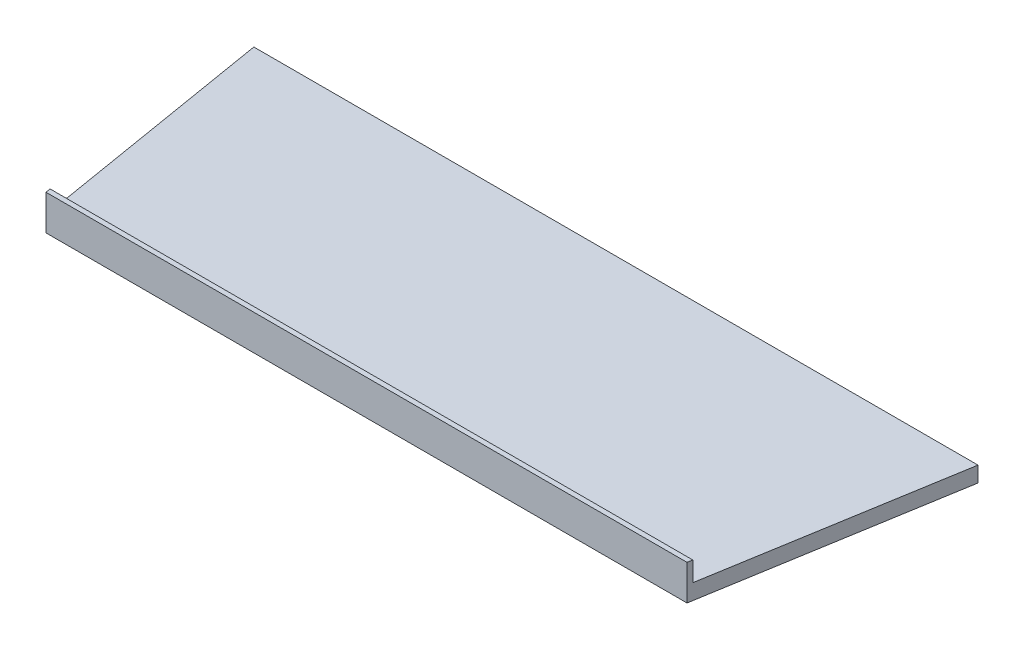
ISO-10303-21;
HEADER;
FILE_DESCRIPTION(('STEP AP214'),'2;1');
FILE_NAME('part.step','',(''),(''),'','','');
FILE_SCHEMA(('AUTOMOTIVE_DESIGN { 1 0 10303 214 1 1 1 1 }'));
ENDSEC;
DATA;
#1=APPLICATION_CONTEXT('core data for automotive mechanical design processes');
#2=APPLICATION_PROTOCOL_DEFINITION('international standard','automotive_design',2000,#1);
#3=PRODUCT_CONTEXT('',#1,'mechanical');
#4=PRODUCT('Part','Part','',(#3));
#5=PRODUCT_RELATED_PRODUCT_CATEGORY('part','',(#4));
#6=PRODUCT_DEFINITION_FORMATION('','',#4);
#7=PRODUCT_DEFINITION_CONTEXT('part definition',#1,'design');
#8=PRODUCT_DEFINITION('design','',#6,#7);
#9=PRODUCT_DEFINITION_SHAPE('','',#8);
#10=(LENGTH_UNIT() NAMED_UNIT(*) SI_UNIT(.MILLI.,.METRE.));
#11=(NAMED_UNIT(*) PLANE_ANGLE_UNIT() SI_UNIT($,.RADIAN.));
#12=(NAMED_UNIT(*) SI_UNIT($,.STERADIAN.) SOLID_ANGLE_UNIT());
#13=UNCERTAINTY_MEASURE_WITH_UNIT(LENGTH_MEASURE(1.E-05),#10,'distance_accuracy_value','');
#14=(GEOMETRIC_REPRESENTATION_CONTEXT(3) GLOBAL_UNCERTAINTY_ASSIGNED_CONTEXT((#13)) GLOBAL_UNIT_ASSIGNED_CONTEXT((#10,
#11,#12)) REPRESENTATION_CONTEXT('',''));
#15=CARTESIAN_POINT('',(0.,0.,0.));
#16=DIRECTION('',(0.,0.,1.));
#17=DIRECTION('',(1.,0.,0.));
#18=AXIS2_PLACEMENT_3D('',#15,#16,#17);
#19=CARTESIAN_POINT('',(200.177654251354,10.,33.3629423752253));
#20=DIRECTION('',(0.986393923832144,0.,0.164398987305356));
#21=DIRECTION('',(0.164398987305356,0.,-0.986393923832144));
#22=AXIS2_PLACEMENT_3D('',#19,#20,#21);
#23=PLANE('',#22);
#24=DIRECTION('',(-0.164398987305356,0.,0.986393923832144));
#25=VECTOR('',#24,1.);
#26=CARTESIAN_POINT('',(200.177654251354,0.,33.3629423752253));
#27=LINE('',#26,#25);
#28=CARTESIAN_POINT('',(218.189405391345,0.,-74.7075644647225));
#29=VERTEX_POINT('',#28);
#30=CARTESIAN_POINT('',(191.397738724679,0.,86.0424355352775));
#31=VERTEX_POINT('',#30);
#32=EDGE_CURVE('E102',#29,#31,#27,.T.);
#33=ORIENTED_EDGE('',*,*,#32,.F.);
#34=DIRECTION('',(0.,-1.,0.));
#35=VECTOR('',#34,1.);
#36=CARTESIAN_POINT('',(218.189405391345,10.,-74.7075644647225));
#37=LINE('',#36,#35);
#38=CARTESIAN_POINT('',(218.189405391345,10.,-74.7075644647225));
#39=VERTEX_POINT('',#38);
#40=EDGE_CURVE('E104',#39,#29,#37,.T.);
#41=ORIENTED_EDGE('',*,*,#40,.F.);
#42=DIRECTION('',(-0.164398987305356,0.,0.986393923832144));
#43=VECTOR('',#42,1.);
#44=CARTESIAN_POINT('',(200.177654251354,10.,33.3629423752253));
#45=LINE('',#44,#43);
#46=CARTESIAN_POINT('',(191.926905391345,10.,82.8674355352775));
#47=VERTEX_POINT('',#46);
#48=EDGE_CURVE('E132',#39,#47,#45,.T.);
#49=ORIENTED_EDGE('',*,*,#48,.T.);
#50=DIRECTION('',(0.,-1.,0.));
#51=VECTOR('',#50,1.);
#52=CARTESIAN_POINT('',(191.926905391345,22.7,82.8674355352775));
#53=LINE('',#52,#51);
#54=CARTESIAN_POINT('',(191.926905391345,22.7,82.8674355352775));
#55=VERTEX_POINT('',#54);
#56=EDGE_CURVE('E121',#55,#47,#53,.T.);
#57=ORIENTED_EDGE('',*,*,#56,.F.);
#58=DIRECTION('',(0.164398987305359,0.,-0.986393923832143));
#59=VECTOR('',#58,1.);
#60=CARTESIAN_POINT('',(191.397738724679,22.7,86.0424355352775));
#61=LINE('',#60,#59);
#62=CARTESIAN_POINT('',(191.397738724679,22.7,86.0424355352775));
#63=VERTEX_POINT('',#62);
#64=EDGE_CURVE('E143',#63,#55,#61,.T.);
#65=ORIENTED_EDGE('',*,*,#64,.F.);
#66=DIRECTION('',(0.,-1.,0.));
#67=VECTOR('',#66,1.);
#68=CARTESIAN_POINT('',(191.397738724679,10.,86.0424355352775));
#69=LINE('',#68,#67);
#70=EDGE_CURVE('E71',#63,#31,#69,.T.);
#71=ORIENTED_EDGE('',*,*,#70,.T.);
#72=EDGE_LOOP('',(#33,#41,#49,#57,#65,#71));
#73=FACE_BOUND('',#72,.T.);
#74=ADVANCED_FACE('F62',(#73),#23,.T.);
#75=CARTESIAN_POINT('',(-229.70367619252,10.,38.2839460320869));
#76=DIRECTION('',(0.986393923832144,0.,-0.164398987305359));
#77=DIRECTION('',(-0.164398987305359,0.,-0.986393923832144));
#78=AXIS2_PLACEMENT_3D('',#75,#76,#77);
#79=PLANE('',#78);
#80=DIRECTION('',(0.164398987305359,0.,0.986393923832144));
#81=VECTOR('',#80,1.);
#82=CARTESIAN_POINT('',(-229.70367619252,0.,38.2839460320869));
#83=LINE('',#82,#81);
#84=CARTESIAN_POINT('',(-248.535594608655,0.,-74.7075644647225));
#85=VERTEX_POINT('',#84);
#86=CARTESIAN_POINT('',(-221.743927941988,0.,86.0424355352775));
#87=VERTEX_POINT('',#86);
#88=EDGE_CURVE('E110',#85,#87,#83,.T.);
#89=ORIENTED_EDGE('',*,*,#88,.T.);
#90=DIRECTION('',(0.,-1.,0.));
#91=VECTOR('',#90,1.);
#92=CARTESIAN_POINT('',(-221.743927941988,10.,86.0424355352775));
#93=LINE('',#92,#91);
#94=CARTESIAN_POINT('',(-221.743927941988,22.7,86.0424355352775));
#95=VERTEX_POINT('',#94);
#96=EDGE_CURVE('E12',#95,#87,#93,.T.);
#97=ORIENTED_EDGE('',*,*,#96,.F.);
#98=DIRECTION('',(0.164398987305351,0.,0.986393923832145));
#99=VECTOR('',#98,1.);
#100=CARTESIAN_POINT('',(-222.273094608655,22.7,82.8674355352776));
#101=LINE('',#100,#99);
#102=CARTESIAN_POINT('',(-222.273094608655,22.7,82.8674355352776));
#103=VERTEX_POINT('',#102);
#104=EDGE_CURVE('E140',#103,#95,#101,.T.);
#105=ORIENTED_EDGE('',*,*,#104,.F.);
#106=DIRECTION('',(0.,-1.,0.));
#107=VECTOR('',#106,1.);
#108=CARTESIAN_POINT('',(-222.273094608655,22.7,82.8674355352776));
#109=LINE('',#108,#107);
#110=CARTESIAN_POINT('',(-222.273094608655,10.,82.8674355352776));
#111=VERTEX_POINT('',#110);
#112=EDGE_CURVE('E125',#103,#111,#109,.T.);
#113=ORIENTED_EDGE('',*,*,#112,.T.);
#114=DIRECTION('',(0.164398987305359,0.,0.986393923832144));
#115=VECTOR('',#114,1.);
#116=CARTESIAN_POINT('',(-229.70367619252,10.,38.2839460320869));
#117=LINE('',#116,#115);
#118=CARTESIAN_POINT('',(-248.535594608655,10.,-74.7075644647225));
#119=VERTEX_POINT('',#118);
#120=EDGE_CURVE('E129',#119,#111,#117,.T.);
#121=ORIENTED_EDGE('',*,*,#120,.F.);
#122=DIRECTION('',(0.,-1.,0.));
#123=VECTOR('',#122,1.);
#124=CARTESIAN_POINT('',(-248.535594608655,10.,-74.7075644647225));
#125=LINE('',#124,#123);
#126=EDGE_CURVE('E66',#119,#85,#125,.T.);
#127=ORIENTED_EDGE('',*,*,#126,.T.);
#128=EDGE_LOOP('',(#89,#97,#105,#113,#121,#127));
#129=FACE_BOUND('',#128,.T.);
#130=ADVANCED_FACE('F162',(#129),#79,.F.);
#131=CARTESIAN_POINT('',(0.,10.,86.0424355352775));
#132=DIRECTION('',(0.,0.,1.));
#133=DIRECTION('',(1.,0.,0.));
#134=AXIS2_PLACEMENT_3D('',#131,#132,#133);
#135=PLANE('',#134);
#136=DIRECTION('',(-1.,0.,0.));
#137=VECTOR('',#136,1.);
#138=CARTESIAN_POINT('',(0.,0.,86.0424355352775));
#139=LINE('',#138,#137);
#140=EDGE_CURVE('E130',#31,#87,#139,.T.);
#141=ORIENTED_EDGE('',*,*,#140,.F.);
#142=ORIENTED_EDGE('',*,*,#70,.F.);
#143=DIRECTION('',(1.,0.,0.));
#144=VECTOR('',#143,1.);
#145=CARTESIAN_POINT('',(-221.743927941988,22.7,86.0424355352775));
#146=LINE('',#145,#144);
#147=EDGE_CURVE('E146',#95,#63,#146,.T.);
#148=ORIENTED_EDGE('',*,*,#147,.F.);
#149=ORIENTED_EDGE('',*,*,#96,.T.);
#150=EDGE_LOOP('',(#141,#142,#148,#149));
#151=FACE_BOUND('',#150,.T.);
#152=ADVANCED_FACE('F172',(#151),#135,.T.);
#153=CARTESIAN_POINT('',(0.,10.,0.));
#154=DIRECTION('',(0.,1.,0.));
#155=DIRECTION('',(0.,0.,1.));
#156=AXIS2_PLACEMENT_3D('',#153,#154,#155);
#157=PLANE('',#156);
#158=DIRECTION('',(-1.,0.,0.));
#159=VECTOR('',#158,1.);
#160=CARTESIAN_POINT('',(191.926905391345,10.,82.8674355352775));
#161=LINE('',#160,#159);
#162=EDGE_CURVE('E79',#47,#111,#161,.T.);
#163=ORIENTED_EDGE('',*,*,#162,.F.);
#164=ORIENTED_EDGE('',*,*,#48,.F.);
#165=DIRECTION('',(1.,0.,0.));
#166=VECTOR('',#165,1.);
#167=CARTESIAN_POINT('',(-248.535594608655,10.,-74.7075644647225));
#168=LINE('',#167,#166);
#169=EDGE_CURVE('E117',#119,#39,#168,.T.);
#170=ORIENTED_EDGE('',*,*,#169,.F.);
#171=ORIENTED_EDGE('',*,*,#120,.T.);
#172=EDGE_LOOP('',(#163,#164,#170,#171));
#173=FACE_BOUND('',#172,.T.);
#174=ADVANCED_FACE('F167',(#173),#157,.T.);
#175=CARTESIAN_POINT('',(0.,0.,0.));
#176=DIRECTION('',(0.,1.,0.));
#177=DIRECTION('',(0.,0.,1.));
#178=AXIS2_PLACEMENT_3D('',#175,#176,#177);
#179=PLANE('',#178);
#180=ORIENTED_EDGE('',*,*,#32,.T.);
#181=ORIENTED_EDGE('',*,*,#140,.T.);
#182=ORIENTED_EDGE('',*,*,#88,.F.);
#183=DIRECTION('',(1.,0.,0.));
#184=VECTOR('',#183,1.);
#185=CARTESIAN_POINT('',(-248.535594608655,0.,-74.7075644647225));
#186=LINE('',#185,#184);
#187=EDGE_CURVE('E115',#85,#29,#186,.T.);
#188=ORIENTED_EDGE('',*,*,#187,.T.);
#189=EDGE_LOOP('',(#180,#181,#182,#188));
#190=FACE_BOUND('',#189,.T.);
#191=ADVANCED_FACE('F118',(#190),#179,.F.);
#192=CARTESIAN_POINT('',(-248.535594608655,10.,-74.7075644647225));
#193=DIRECTION('',(0.,0.,-1.));
#194=DIRECTION('',(-1.,0.,0.));
#195=AXIS2_PLACEMENT_3D('',#192,#193,#194);
#196=PLANE('',#195);
#197=ORIENTED_EDGE('',*,*,#187,.F.);
#198=ORIENTED_EDGE('',*,*,#126,.F.);
#199=ORIENTED_EDGE('',*,*,#169,.T.);
#200=ORIENTED_EDGE('',*,*,#40,.T.);
#201=EDGE_LOOP('',(#197,#198,#199,#200));
#202=FACE_BOUND('',#201,.T.);
#203=ADVANCED_FACE('F64',(#202),#196,.T.);
#204=CARTESIAN_POINT('',(191.926905391345,22.7,82.8674355352775));
#205=DIRECTION('',(0.,0.,1.));
#206=DIRECTION('',(1.,0.,0.));
#207=AXIS2_PLACEMENT_3D('',#204,#205,#206);
#208=PLANE('',#207);
#209=ORIENTED_EDGE('',*,*,#162,.T.);
#210=ORIENTED_EDGE('',*,*,#112,.F.);
#211=DIRECTION('',(-1.,0.,0.));
#212=VECTOR('',#211,1.);
#213=CARTESIAN_POINT('',(191.926905391345,22.7,82.8674355352775));
#214=LINE('',#213,#212);
#215=EDGE_CURVE('E138',#55,#103,#214,.T.);
#216=ORIENTED_EDGE('',*,*,#215,.F.);
#217=ORIENTED_EDGE('',*,*,#56,.T.);
#218=EDGE_LOOP('',(#209,#210,#216,#217));
#219=FACE_BOUND('',#218,.T.);
#220=ADVANCED_FACE('F169',(#219),#208,.F.);
#221=CARTESIAN_POINT('',(0.,22.7,0.));
#222=DIRECTION('',(0.,1.,0.));
#223=DIRECTION('',(0.,0.,1.));
#224=AXIS2_PLACEMENT_3D('',#221,#222,#223);
#225=PLANE('',#224);
#226=ORIENTED_EDGE('',*,*,#104,.T.);
#227=ORIENTED_EDGE('',*,*,#147,.T.);
#228=ORIENTED_EDGE('',*,*,#64,.T.);
#229=ORIENTED_EDGE('',*,*,#215,.T.);
#230=EDGE_LOOP('',(#226,#227,#228,#229));
#231=FACE_BOUND('',#230,.T.);
#232=ADVANCED_FACE('F153',(#231),#225,.T.);
#233=CLOSED_SHELL('',(#74,#130,#152,#174,#191,#203,#220,#232));
#234=MANIFOLD_SOLID_BREP('B2',#233);
#235=ADVANCED_BREP_SHAPE_REPRESENTATION('',(#18,#234),#14);
#236=SHAPE_DEFINITION_REPRESENTATION(#9,#235);
ENDSEC;
END-ISO-10303-21;
